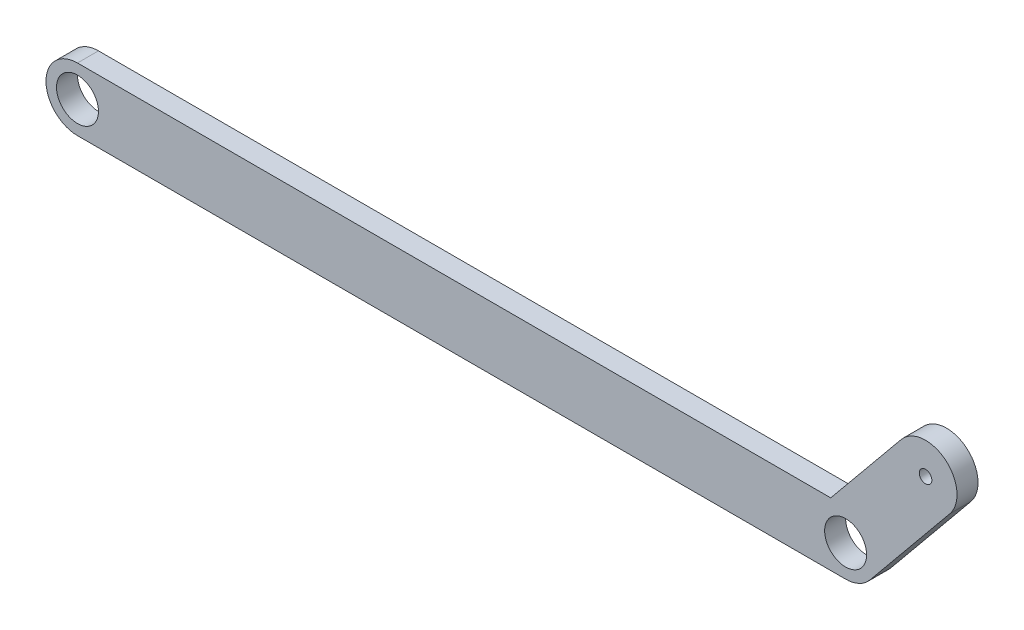
ISO-10303-21;
HEADER;
FILE_DESCRIPTION(('STEP AP214'),'2;1');
FILE_NAME('part.step','',(''),(''),'','','');
FILE_SCHEMA(('AUTOMOTIVE_DESIGN { 1 0 10303 214 1 1 1 1 }'));
ENDSEC;
DATA;
#1=APPLICATION_CONTEXT('core data for automotive mechanical design processes');
#2=APPLICATION_PROTOCOL_DEFINITION('international standard','automotive_design',2000,#1);
#3=PRODUCT_CONTEXT('',#1,'mechanical');
#4=PRODUCT('Part','Part','',(#3));
#5=PRODUCT_RELATED_PRODUCT_CATEGORY('part','',(#4));
#6=PRODUCT_DEFINITION_FORMATION('','',#4);
#7=PRODUCT_DEFINITION_CONTEXT('part definition',#1,'design');
#8=PRODUCT_DEFINITION('design','',#6,#7);
#9=PRODUCT_DEFINITION_SHAPE('','',#8);
#10=(LENGTH_UNIT() NAMED_UNIT(*) SI_UNIT(.MILLI.,.METRE.));
#11=(NAMED_UNIT(*) PLANE_ANGLE_UNIT() SI_UNIT($,.RADIAN.));
#12=(NAMED_UNIT(*) SI_UNIT($,.STERADIAN.) SOLID_ANGLE_UNIT());
#13=UNCERTAINTY_MEASURE_WITH_UNIT(LENGTH_MEASURE(1.E-05),#10,'distance_accuracy_value','');
#14=(GEOMETRIC_REPRESENTATION_CONTEXT(3) GLOBAL_UNCERTAINTY_ASSIGNED_CONTEXT((#13)) GLOBAL_UNIT_ASSIGNED_CONTEXT((#10,
#11,#12)) REPRESENTATION_CONTEXT('',''));
#15=CARTESIAN_POINT('',(0.,0.,0.));
#16=DIRECTION('',(0.,0.,1.));
#17=DIRECTION('',(1.,0.,0.));
#18=AXIS2_PLACEMENT_3D('',#15,#16,#17);
#19=CARTESIAN_POINT('',(0.,0.,5.));
#20=DIRECTION('',(0.,0.,1.));
#21=DIRECTION('',(1.,0.,0.));
#22=AXIS2_PLACEMENT_3D('',#19,#20,#21);
#23=PLANE('',#22);
#24=DIRECTION('',(-0.634668143942255,-0.772784799970142,0.));
#25=VECTOR('',#24,1.);
#26=CARTESIAN_POINT('',(79.2185235414652,-65.0601219173179,5.));
#27=LINE('',#26,#25);
#28=CARTESIAN_POINT('',(156.950074628911,29.5873906951095,5.));
#29=VERTEX_POINT('',#28);
#30=CARTESIAN_POINT('',(140.160312255398,9.14383561643836,5.));
#31=VERTEX_POINT('',#30);
#32=EDGE_CURVE('E174',#29,#31,#27,.T.);
#33=ORIENTED_EDGE('',*,*,#32,.T.);
#34=DIRECTION('',(-1.,0.,0.));
#35=VECTOR('',#34,1.);
#36=CARTESIAN_POINT('',(-46.7940836895809,9.14383561643835,5.));
#37=LINE('',#36,#35);
#38=CARTESIAN_POINT('',(-39.2940836895809,9.14383561643835,5.));
#39=VERTEX_POINT('',#38);
#40=EDGE_CURVE('E12',#31,#39,#37,.T.);
#41=ORIENTED_EDGE('',*,*,#40,.T.);
#42=CARTESIAN_POINT('',(-39.2940836895809,1.64383561643833,5.));
#43=DIRECTION('',(0.,0.,1.));
#44=DIRECTION('',(1.,0.,0.));
#45=AXIS2_PLACEMENT_3D('',#42,#43,#44);
#46=CIRCLE('',#45,7.5);
#47=CARTESIAN_POINT('',(-39.2940836895809,-5.85616438356164,5.));
#48=VERTEX_POINT('',#47);
#49=EDGE_CURVE('E199',#39,#48,#46,.T.);
#50=ORIENTED_EDGE('',*,*,#49,.T.);
#51=DIRECTION('',(1.,0.,0.));
#52=VECTOR('',#51,1.);
#53=CARTESIAN_POINT('',(-46.7940836895809,-5.85616438356164,5.));
#54=LINE('',#53,#52);
#55=CARTESIAN_POINT('',(143.705916310419,-5.85616438356164,5.));
#56=VERTEX_POINT('',#55);
#57=EDGE_CURVE('E96',#48,#56,#54,.T.);
#58=ORIENTED_EDGE('',*,*,#57,.T.);
#59=CARTESIAN_POINT('',(143.705916310419,1.64383561643833,5.));
#60=DIRECTION('',(0.,0.,1.));
#61=DIRECTION('',(1.,0.,0.));
#62=AXIS2_PLACEMENT_3D('',#59,#60,#61);
#63=CIRCLE('',#62,7.50000000000001);
#64=CARTESIAN_POINT('',(149.501802310195,-3.11617546312859,5.));
#65=VERTEX_POINT('',#64);
#66=EDGE_CURVE('E195',#56,#65,#63,.T.);
#67=ORIENTED_EDGE('',*,*,#66,.T.);
#68=DIRECTION('',(0.634668143942256,0.772784799970142,0.));
#69=VECTOR('',#68,1.);
#70=CARTESIAN_POINT('',(90.8102955410172,-74.5801440764517,5.));
#71=LINE('',#70,#69);
#72=CARTESIAN_POINT('',(168.541846628463,20.0673685359757,5.));
#73=VERTEX_POINT('',#72);
#74=EDGE_CURVE('E181',#65,#73,#71,.T.);
#75=ORIENTED_EDGE('',*,*,#74,.T.);
#76=CARTESIAN_POINT('',(162.745960628687,24.8273796155426,5.));
#77=DIRECTION('',(0.,0.,1.));
#78=DIRECTION('',(1.,0.,0.));
#79=AXIS2_PLACEMENT_3D('',#76,#77,#78);
#80=CIRCLE('',#79,7.5);
#81=EDGE_CURVE('E153',#73,#29,#80,.T.);
#82=ORIENTED_EDGE('',*,*,#81,.T.);
#83=EDGE_LOOP('',(#33,#41,#50,#58,#67,#75,#82));
#84=FACE_BOUND('',#83,.T.);
#85=CARTESIAN_POINT('',(-39.2940836895809,1.64383561643833,5.));
#86=DIRECTION('',(0.,0.,1.));
#87=DIRECTION('',(1.,0.,0.));
#88=AXIS2_PLACEMENT_3D('',#85,#86,#87);
#89=CIRCLE('',#88,5.);
#90=CARTESIAN_POINT('',(-34.2940836895809,1.64383561643833,5.));
#91=VERTEX_POINT('',#90);
#92=EDGE_CURVE('E203',#91,#91,#89,.T.);
#93=ORIENTED_EDGE('',*,*,#92,.F.);
#94=EDGE_LOOP('',(#93));
#95=FACE_BOUND('',#94,.T.);
#96=CARTESIAN_POINT('',(143.705916310419,1.64383561643833,5.));
#97=DIRECTION('',(0.,0.,1.));
#98=DIRECTION('',(1.,0.,0.));
#99=AXIS2_PLACEMENT_3D('',#96,#97,#98);
#100=CIRCLE('',#99,5.00000000000002);
#101=CARTESIAN_POINT('',(148.705916310419,1.64383561643833,5.));
#102=VERTEX_POINT('',#101);
#103=EDGE_CURVE('E212',#102,#102,#100,.T.);
#104=ORIENTED_EDGE('',*,*,#103,.F.);
#105=EDGE_LOOP('',(#104));
#106=FACE_BOUND('',#105,.T.);
#107=CARTESIAN_POINT('',(162.745960628687,24.8273796155426,5.));
#108=DIRECTION('',(0.,0.,1.));
#109=DIRECTION('',(1.,0.,0.));
#110=AXIS2_PLACEMENT_3D('',#107,#108,#109);
#111=CIRCLE('',#110,1.5);
#112=CARTESIAN_POINT('',(164.245960628687,24.8273796155426,5.));
#113=VERTEX_POINT('',#112);
#114=EDGE_CURVE('E178',#113,#113,#111,.T.);
#115=ORIENTED_EDGE('',*,*,#114,.F.);
#116=EDGE_LOOP('',(#115));
#117=FACE_BOUND('',#116,.T.);
#118=ADVANCED_FACE('F87',(#84,#95,#106,#117),#23,.T.);
#119=CARTESIAN_POINT('',(0.,0.,0.));
#120=DIRECTION('',(0.,0.,1.));
#121=DIRECTION('',(1.,0.,0.));
#122=AXIS2_PLACEMENT_3D('',#119,#120,#121);
#123=PLANE('',#122);
#124=DIRECTION('',(-1.,0.,0.));
#125=VECTOR('',#124,1.);
#126=CARTESIAN_POINT('',(-46.7940836895809,9.14383561643835,0.));
#127=LINE('',#126,#125);
#128=CARTESIAN_POINT('',(140.160312255398,9.14383561643836,0.));
#129=VERTEX_POINT('',#128);
#130=CARTESIAN_POINT('',(-39.2940836895809,9.14383561643835,0.));
#131=VERTEX_POINT('',#130);
#132=EDGE_CURVE('E91',#129,#131,#127,.T.);
#133=ORIENTED_EDGE('',*,*,#132,.F.);
#134=DIRECTION('',(-0.634668143942255,-0.772784799970142,0.));
#135=VECTOR('',#134,1.);
#136=CARTESIAN_POINT('',(79.2185235414652,-65.0601219173179,0.));
#137=LINE('',#136,#135);
#138=CARTESIAN_POINT('',(156.950074628911,29.5873906951095,0.));
#139=VERTEX_POINT('',#138);
#140=EDGE_CURVE('E158',#139,#129,#137,.T.);
#141=ORIENTED_EDGE('',*,*,#140,.F.);
#142=CARTESIAN_POINT('',(162.745960628687,24.8273796155426,0.));
#143=DIRECTION('',(0.,0.,1.));
#144=DIRECTION('',(1.,0.,0.));
#145=AXIS2_PLACEMENT_3D('',#142,#143,#144);
#146=CIRCLE('',#145,7.5);
#147=CARTESIAN_POINT('',(168.541846628463,20.0673685359757,0.));
#148=VERTEX_POINT('',#147);
#149=EDGE_CURVE('E151',#148,#139,#146,.T.);
#150=ORIENTED_EDGE('',*,*,#149,.F.);
#151=DIRECTION('',(0.634668143942256,0.772784799970142,0.));
#152=VECTOR('',#151,1.);
#153=CARTESIAN_POINT('',(90.8102955410172,-74.5801440764517,0.));
#154=LINE('',#153,#152);
#155=CARTESIAN_POINT('',(149.501802310195,-3.11617546312859,0.));
#156=VERTEX_POINT('',#155);
#157=EDGE_CURVE('E165',#156,#148,#154,.T.);
#158=ORIENTED_EDGE('',*,*,#157,.F.);
#159=CARTESIAN_POINT('',(143.705916310419,1.64383561643833,0.));
#160=DIRECTION('',(0.,0.,1.));
#161=DIRECTION('',(1.,0.,0.));
#162=AXIS2_PLACEMENT_3D('',#159,#160,#161);
#163=CIRCLE('',#162,7.50000000000001);
#164=CARTESIAN_POINT('',(143.705916310419,-5.85616438356164,0.));
#165=VERTEX_POINT('',#164);
#166=EDGE_CURVE('E210',#165,#156,#163,.T.);
#167=ORIENTED_EDGE('',*,*,#166,.F.);
#168=DIRECTION('',(1.,0.,0.));
#169=VECTOR('',#168,1.);
#170=CARTESIAN_POINT('',(-46.7940836895809,-5.85616438356164,0.));
#171=LINE('',#170,#169);
#172=CARTESIAN_POINT('',(-39.2940836895809,-5.85616438356164,0.));
#173=VERTEX_POINT('',#172);
#174=EDGE_CURVE('E207',#173,#165,#171,.T.);
#175=ORIENTED_EDGE('',*,*,#174,.F.);
#176=CARTESIAN_POINT('',(-39.2940836895809,1.64383561643833,0.));
#177=DIRECTION('',(0.,0.,1.));
#178=DIRECTION('',(1.,0.,0.));
#179=AXIS2_PLACEMENT_3D('',#176,#177,#178);
#180=CIRCLE('',#179,7.5);
#181=EDGE_CURVE('E196',#131,#173,#180,.T.);
#182=ORIENTED_EDGE('',*,*,#181,.F.);
#183=EDGE_LOOP('',(#133,#141,#150,#158,#167,#175,#182));
#184=FACE_BOUND('',#183,.T.);
#185=CARTESIAN_POINT('',(143.705916310419,1.64383561643833,0.));
#186=DIRECTION('',(0.,0.,1.));
#187=DIRECTION('',(1.,0.,0.));
#188=AXIS2_PLACEMENT_3D('',#185,#186,#187);
#189=CIRCLE('',#188,5.00000000000002);
#190=CARTESIAN_POINT('',(148.705916310419,1.64383561643833,0.));
#191=VERTEX_POINT('',#190);
#192=EDGE_CURVE('E201',#191,#191,#189,.T.);
#193=ORIENTED_EDGE('',*,*,#192,.T.);
#194=EDGE_LOOP('',(#193));
#195=FACE_BOUND('',#194,.T.);
#196=CARTESIAN_POINT('',(-39.2940836895809,1.64383561643833,0.));
#197=DIRECTION('',(0.,0.,1.));
#198=DIRECTION('',(1.,0.,0.));
#199=AXIS2_PLACEMENT_3D('',#196,#197,#198);
#200=CIRCLE('',#199,5.);
#201=CARTESIAN_POINT('',(-34.2940836895809,1.64383561643833,0.));
#202=VERTEX_POINT('',#201);
#203=EDGE_CURVE('E204',#202,#202,#200,.T.);
#204=ORIENTED_EDGE('',*,*,#203,.T.);
#205=EDGE_LOOP('',(#204));
#206=FACE_BOUND('',#205,.T.);
#207=CARTESIAN_POINT('',(162.745960628687,24.8273796155426,0.));
#208=DIRECTION('',(0.,0.,1.));
#209=DIRECTION('',(1.,0.,0.));
#210=AXIS2_PLACEMENT_3D('',#207,#208,#209);
#211=CIRCLE('',#210,1.5);
#212=CARTESIAN_POINT('',(164.245960628687,24.8273796155426,0.));
#213=VERTEX_POINT('',#212);
#214=EDGE_CURVE('E171',#213,#213,#211,.T.);
#215=ORIENTED_EDGE('',*,*,#214,.T.);
#216=EDGE_LOOP('',(#215));
#217=FACE_BOUND('',#216,.T.);
#218=ADVANCED_FACE('F163',(#184,#195,#206,#217),#123,.F.);
#219=CARTESIAN_POINT('',(-46.7940836895809,-5.85616438356164,5.));
#220=DIRECTION('',(0.,1.,0.));
#221=DIRECTION('',(0.,0.,1.));
#222=AXIS2_PLACEMENT_3D('',#219,#220,#221);
#223=PLANE('',#222);
#224=ORIENTED_EDGE('',*,*,#174,.T.);
#225=DIRECTION('',(0.,0.,1.));
#226=VECTOR('',#225,1.);
#227=CARTESIAN_POINT('',(143.705916310419,-5.85616438356164,0.));
#228=LINE('',#227,#226);
#229=EDGE_CURVE('E186',#165,#56,#228,.T.);
#230=ORIENTED_EDGE('',*,*,#229,.T.);
#231=ORIENTED_EDGE('',*,*,#57,.F.);
#232=DIRECTION('',(0.,0.,1.));
#233=VECTOR('',#232,1.);
#234=CARTESIAN_POINT('',(-39.2940836895809,-5.85616438356164,0.));
#235=LINE('',#234,#233);
#236=EDGE_CURVE('E192',#173,#48,#235,.T.);
#237=ORIENTED_EDGE('',*,*,#236,.F.);
#238=EDGE_LOOP('',(#224,#230,#231,#237));
#239=FACE_BOUND('',#238,.T.);
#240=ADVANCED_FACE('F89',(#239),#223,.F.);
#241=CARTESIAN_POINT('',(-46.7940836895809,9.14383561643835,5.));
#242=DIRECTION('',(0.,-1.,0.));
#243=DIRECTION('',(0.,0.,-1.));
#244=AXIS2_PLACEMENT_3D('',#241,#242,#243);
#245=PLANE('',#244);
#246=ORIENTED_EDGE('',*,*,#40,.F.);
#247=DIRECTION('',(0.,0.,1.));
#248=VECTOR('',#247,1.);
#249=CARTESIAN_POINT('',(140.160312255398,9.14383561643836,0.));
#250=LINE('',#249,#248);
#251=EDGE_CURVE('E187',#129,#31,#250,.T.);
#252=ORIENTED_EDGE('',*,*,#251,.F.);
#253=ORIENTED_EDGE('',*,*,#132,.T.);
#254=DIRECTION('',(0.,0.,1.));
#255=VECTOR('',#254,1.);
#256=CARTESIAN_POINT('',(-39.2940836895809,9.14383561643835,0.));
#257=LINE('',#256,#255);
#258=EDGE_CURVE('E198',#131,#39,#257,.T.);
#259=ORIENTED_EDGE('',*,*,#258,.T.);
#260=EDGE_LOOP('',(#246,#252,#253,#259));
#261=FACE_BOUND('',#260,.T.);
#262=ADVANCED_FACE('F232',(#261),#245,.F.);
#263=CARTESIAN_POINT('',(143.705916310419,1.64383561643833,0.));
#264=DIRECTION('',(0.,0.,1.));
#265=DIRECTION('',(1.,0.,0.));
#266=AXIS2_PLACEMENT_3D('',#263,#264,#265);
#267=CYLINDRICAL_SURFACE('',#266,5.00000000000002);
#268=ORIENTED_EDGE('',*,*,#192,.F.);
#269=EDGE_LOOP('',(#268));
#270=FACE_BOUND('',#269,.T.);
#271=ORIENTED_EDGE('',*,*,#103,.T.);
#272=EDGE_LOOP('',(#271));
#273=FACE_BOUND('',#272,.T.);
#274=ADVANCED_FACE('F254',(#270,#273),#267,.F.);
#275=CARTESIAN_POINT('',(143.705916310419,1.64383561643833,0.));
#276=DIRECTION('',(0.,0.,1.));
#277=DIRECTION('',(1.,0.,0.));
#278=AXIS2_PLACEMENT_3D('',#275,#276,#277);
#279=CYLINDRICAL_SURFACE('',#278,7.50000000000001);
#280=DIRECTION('',(0.,0.,1.));
#281=VECTOR('',#280,1.);
#282=CARTESIAN_POINT('',(149.501802310195,-3.11617546312859,0.));
#283=LINE('',#282,#281);
#284=EDGE_CURVE('E170',#156,#65,#283,.T.);
#285=ORIENTED_EDGE('',*,*,#284,.T.);
#286=ORIENTED_EDGE('',*,*,#66,.F.);
#287=ORIENTED_EDGE('',*,*,#229,.F.);
#288=ORIENTED_EDGE('',*,*,#166,.T.);
#289=EDGE_LOOP('',(#285,#286,#287,#288));
#290=FACE_BOUND('',#289,.T.);
#291=ADVANCED_FACE('F228',(#290),#279,.T.);
#292=CARTESIAN_POINT('',(-39.2940836895809,1.64383561643833,0.));
#293=DIRECTION('',(0.,0.,1.));
#294=DIRECTION('',(1.,0.,0.));
#295=AXIS2_PLACEMENT_3D('',#292,#293,#294);
#296=CYLINDRICAL_SURFACE('',#295,5.);
#297=ORIENTED_EDGE('',*,*,#203,.F.);
#298=EDGE_LOOP('',(#297));
#299=FACE_BOUND('',#298,.T.);
#300=ORIENTED_EDGE('',*,*,#92,.T.);
#301=EDGE_LOOP('',(#300));
#302=FACE_BOUND('',#301,.T.);
#303=ADVANCED_FACE('F287',(#299,#302),#296,.F.);
#304=CARTESIAN_POINT('',(-39.2940836895809,1.64383561643833,0.));
#305=DIRECTION('',(0.,0.,1.));
#306=DIRECTION('',(1.,0.,0.));
#307=AXIS2_PLACEMENT_3D('',#304,#305,#306);
#308=CYLINDRICAL_SURFACE('',#307,7.5);
#309=ORIENTED_EDGE('',*,*,#49,.F.);
#310=ORIENTED_EDGE('',*,*,#258,.F.);
#311=ORIENTED_EDGE('',*,*,#181,.T.);
#312=ORIENTED_EDGE('',*,*,#236,.T.);
#313=EDGE_LOOP('',(#309,#310,#311,#312));
#314=FACE_BOUND('',#313,.T.);
#315=ADVANCED_FACE('F231',(#314),#308,.T.);
#316=CARTESIAN_POINT('',(90.8102955410172,-74.5801440764517,0.));
#317=DIRECTION('',(0.772784799970142,-0.634668143942256,0.));
#318=DIRECTION('',(0.634668143942256,0.772784799970142,0.));
#319=AXIS2_PLACEMENT_3D('',#316,#317,#318);
#320=PLANE('',#319);
#321=ORIENTED_EDGE('',*,*,#74,.F.);
#322=ORIENTED_EDGE('',*,*,#284,.F.);
#323=ORIENTED_EDGE('',*,*,#157,.T.);
#324=DIRECTION('',(0.,0.,1.));
#325=VECTOR('',#324,1.);
#326=CARTESIAN_POINT('',(168.541846628463,20.0673685359757,0.));
#327=LINE('',#326,#325);
#328=EDGE_CURVE('E148',#148,#73,#327,.T.);
#329=ORIENTED_EDGE('',*,*,#328,.T.);
#330=EDGE_LOOP('',(#321,#322,#323,#329));
#331=FACE_BOUND('',#330,.T.);
#332=ADVANCED_FACE('F168',(#331),#320,.T.);
#333=CARTESIAN_POINT('',(79.2185235414652,-65.0601219173179,0.));
#334=DIRECTION('',(-0.772784799970142,0.634668143942255,0.));
#335=DIRECTION('',(-0.634668143942255,-0.772784799970142,0.));
#336=AXIS2_PLACEMENT_3D('',#333,#334,#335);
#337=PLANE('',#336);
#338=ORIENTED_EDGE('',*,*,#32,.F.);
#339=DIRECTION('',(0.,0.,1.));
#340=VECTOR('',#339,1.);
#341=CARTESIAN_POINT('',(156.950074628911,29.5873906951095,0.));
#342=LINE('',#341,#340);
#343=EDGE_CURVE('E157',#139,#29,#342,.T.);
#344=ORIENTED_EDGE('',*,*,#343,.F.);
#345=ORIENTED_EDGE('',*,*,#140,.T.);
#346=ORIENTED_EDGE('',*,*,#251,.T.);
#347=EDGE_LOOP('',(#338,#344,#345,#346));
#348=FACE_BOUND('',#347,.T.);
#349=ADVANCED_FACE('F235',(#348),#337,.T.);
#350=CARTESIAN_POINT('',(162.745960628687,24.8273796155426,0.));
#351=DIRECTION('',(0.,0.,1.));
#352=DIRECTION('',(1.,0.,0.));
#353=AXIS2_PLACEMENT_3D('',#350,#351,#352);
#354=CYLINDRICAL_SURFACE('',#353,1.5);
#355=ORIENTED_EDGE('',*,*,#214,.F.);
#356=EDGE_LOOP('',(#355));
#357=FACE_BOUND('',#356,.T.);
#358=ORIENTED_EDGE('',*,*,#114,.T.);
#359=EDGE_LOOP('',(#358));
#360=FACE_BOUND('',#359,.T.);
#361=ADVANCED_FACE('F237',(#357,#360),#354,.F.);
#362=CARTESIAN_POINT('',(162.745960628687,24.8273796155426,0.));
#363=DIRECTION('',(0.,0.,1.));
#364=DIRECTION('',(1.,0.,0.));
#365=AXIS2_PLACEMENT_3D('',#362,#363,#364);
#366=CYLINDRICAL_SURFACE('',#365,7.5);
#367=ORIENTED_EDGE('',*,*,#81,.F.);
#368=ORIENTED_EDGE('',*,*,#328,.F.);
#369=ORIENTED_EDGE('',*,*,#149,.T.);
#370=ORIENTED_EDGE('',*,*,#343,.T.);
#371=EDGE_LOOP('',(#367,#368,#369,#370));
#372=FACE_BOUND('',#371,.T.);
#373=ADVANCED_FACE('F150',(#372),#366,.T.);
#374=CLOSED_SHELL('',(#118,#218,#240,#262,#274,#291,#303,#315,#332,#349,#361,#373));
#375=MANIFOLD_SOLID_BREP('B2',#374);
#376=ADVANCED_BREP_SHAPE_REPRESENTATION('',(#18,#375),#14);
#377=SHAPE_DEFINITION_REPRESENTATION(#9,#376);
ENDSEC;
END-ISO-10303-21;
